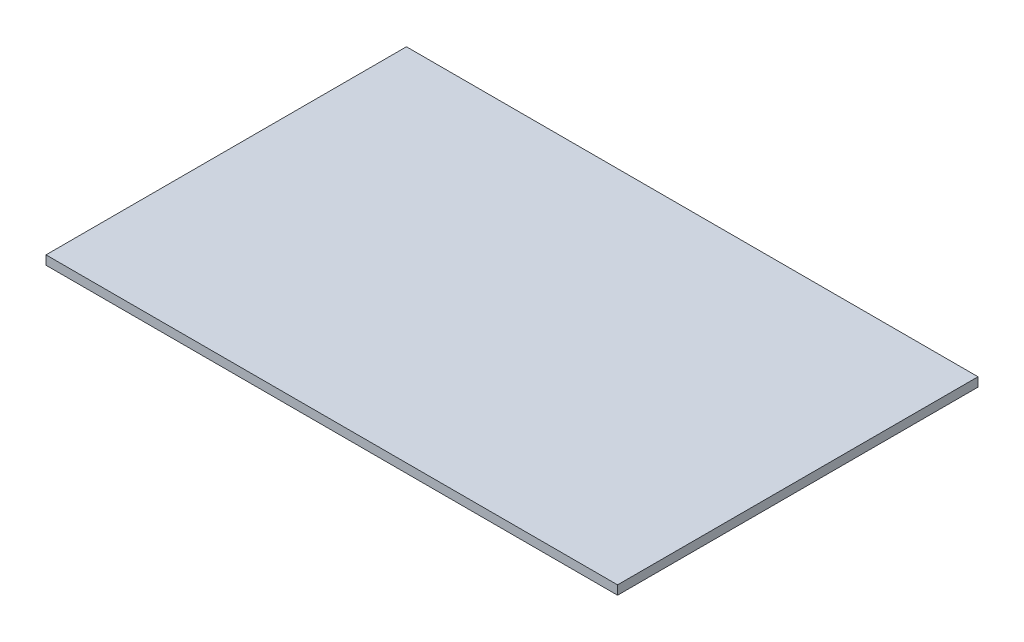
ISO-10303-21;
HEADER;
FILE_DESCRIPTION(('STEP AP214'),'2;1');
FILE_NAME('part.step','',(''),(''),'','','');
FILE_SCHEMA(('AUTOMOTIVE_DESIGN { 1 0 10303 214 1 1 1 1 }'));
ENDSEC;
DATA;
#1=APPLICATION_CONTEXT('core data for automotive mechanical design processes');
#2=APPLICATION_PROTOCOL_DEFINITION('international standard','automotive_design',2000,#1);
#3=PRODUCT_CONTEXT('',#1,'mechanical');
#4=PRODUCT('Part','Part','',(#3));
#5=PRODUCT_RELATED_PRODUCT_CATEGORY('part','',(#4));
#6=PRODUCT_DEFINITION_FORMATION('','',#4);
#7=PRODUCT_DEFINITION_CONTEXT('part definition',#1,'design');
#8=PRODUCT_DEFINITION('design','',#6,#7);
#9=PRODUCT_DEFINITION_SHAPE('','',#8);
#10=(LENGTH_UNIT() NAMED_UNIT(*) SI_UNIT(.MILLI.,.METRE.));
#11=(NAMED_UNIT(*) PLANE_ANGLE_UNIT() SI_UNIT($,.RADIAN.));
#12=(NAMED_UNIT(*) SI_UNIT($,.STERADIAN.) SOLID_ANGLE_UNIT());
#13=UNCERTAINTY_MEASURE_WITH_UNIT(LENGTH_MEASURE(1.E-05),#10,'distance_accuracy_value','');
#14=(GEOMETRIC_REPRESENTATION_CONTEXT(3) GLOBAL_UNCERTAINTY_ASSIGNED_CONTEXT((#13)) GLOBAL_UNIT_ASSIGNED_CONTEXT((#10,
#11,#12)) REPRESENTATION_CONTEXT('',''));
#15=CARTESIAN_POINT('',(0.,0.,0.));
#16=DIRECTION('',(0.,0.,1.));
#17=DIRECTION('',(1.,0.,0.));
#18=AXIS2_PLACEMENT_3D('',#15,#16,#17);
#19=CARTESIAN_POINT('',(-42.8,1.35,26.99));
#20=DIRECTION('',(1.,0.,0.));
#21=DIRECTION('',(0.,0.,-1.));
#22=AXIS2_PLACEMENT_3D('',#19,#20,#21);
#23=PLANE('',#22);
#24=DIRECTION('',(0.,0.,1.));
#25=VECTOR('',#24,1.);
#26=CARTESIAN_POINT('',(-42.8,0.,26.99));
#27=LINE('',#26,#25);
#28=CARTESIAN_POINT('',(-42.8,0.,-26.99));
#29=VERTEX_POINT('',#28);
#30=CARTESIAN_POINT('',(-42.8,0.,26.99));
#31=VERTEX_POINT('',#30);
#32=EDGE_CURVE('E99',#29,#31,#27,.T.);
#33=ORIENTED_EDGE('',*,*,#32,.T.);
#34=DIRECTION('',(0.,-1.,0.));
#35=VECTOR('',#34,1.);
#36=CARTESIAN_POINT('',(-42.8,1.35,26.99));
#37=LINE('',#36,#35);
#38=CARTESIAN_POINT('',(-42.8,1.35,26.99));
#39=VERTEX_POINT('',#38);
#40=EDGE_CURVE('E11',#39,#31,#37,.T.);
#41=ORIENTED_EDGE('',*,*,#40,.F.);
#42=DIRECTION('',(0.,0.,1.));
#43=VECTOR('',#42,1.);
#44=CARTESIAN_POINT('',(-42.8,1.35,26.99));
#45=LINE('',#44,#43);
#46=CARTESIAN_POINT('',(-42.8,1.35,-26.99));
#47=VERTEX_POINT('',#46);
#48=EDGE_CURVE('E87',#47,#39,#45,.T.);
#49=ORIENTED_EDGE('',*,*,#48,.F.);
#50=DIRECTION('',(0.,-1.,0.));
#51=VECTOR('',#50,1.);
#52=CARTESIAN_POINT('',(-42.8,1.35,-26.99));
#53=LINE('',#52,#51);
#54=EDGE_CURVE('E95',#47,#29,#53,.T.);
#55=ORIENTED_EDGE('',*,*,#54,.T.);
#56=EDGE_LOOP('',(#33,#41,#49,#55));
#57=FACE_BOUND('',#56,.T.);
#58=ADVANCED_FACE('F36',(#57),#23,.F.);
#59=CARTESIAN_POINT('',(42.8,1.35,26.99));
#60=DIRECTION('',(0.,0.,-1.));
#61=DIRECTION('',(-1.,0.,0.));
#62=AXIS2_PLACEMENT_3D('',#59,#60,#61);
#63=PLANE('',#62);
#64=DIRECTION('',(1.,0.,0.));
#65=VECTOR('',#64,1.);
#66=CARTESIAN_POINT('',(42.8,0.,26.99));
#67=LINE('',#66,#65);
#68=CARTESIAN_POINT('',(42.8,0.,26.99));
#69=VERTEX_POINT('',#68);
#70=EDGE_CURVE('E91',#31,#69,#67,.T.);
#71=ORIENTED_EDGE('',*,*,#70,.T.);
#72=DIRECTION('',(0.,-1.,0.));
#73=VECTOR('',#72,1.);
#74=CARTESIAN_POINT('',(42.8,1.35,26.99));
#75=LINE('',#74,#73);
#76=CARTESIAN_POINT('',(42.8,1.35,26.99));
#77=VERTEX_POINT('',#76);
#78=EDGE_CURVE('E44',#77,#69,#75,.T.);
#79=ORIENTED_EDGE('',*,*,#78,.F.);
#80=DIRECTION('',(1.,0.,0.));
#81=VECTOR('',#80,1.);
#82=CARTESIAN_POINT('',(42.8,1.35,26.99));
#83=LINE('',#82,#81);
#84=EDGE_CURVE('E82',#39,#77,#83,.T.);
#85=ORIENTED_EDGE('',*,*,#84,.F.);
#86=ORIENTED_EDGE('',*,*,#40,.T.);
#87=EDGE_LOOP('',(#71,#79,#85,#86));
#88=FACE_BOUND('',#87,.T.);
#89=ADVANCED_FACE('F90',(#88),#63,.F.);
#90=CARTESIAN_POINT('',(42.8,1.35,26.99));
#91=DIRECTION('',(-1.,0.,0.));
#92=DIRECTION('',(0.,0.,1.));
#93=AXIS2_PLACEMENT_3D('',#90,#91,#92);
#94=PLANE('',#93);
#95=DIRECTION('',(0.,0.,-1.));
#96=VECTOR('',#95,1.);
#97=CARTESIAN_POINT('',(42.8,0.,26.99));
#98=LINE('',#97,#96);
#99=CARTESIAN_POINT('',(42.8,0.,-26.99));
#100=VERTEX_POINT('',#99);
#101=EDGE_CURVE('E69',#69,#100,#98,.T.);
#102=ORIENTED_EDGE('',*,*,#101,.T.);
#103=DIRECTION('',(0.,-1.,0.));
#104=VECTOR('',#103,1.);
#105=CARTESIAN_POINT('',(42.8,1.35,-26.99));
#106=LINE('',#105,#104);
#107=CARTESIAN_POINT('',(42.8,1.35,-26.99));
#108=VERTEX_POINT('',#107);
#109=EDGE_CURVE('E92',#108,#100,#106,.T.);
#110=ORIENTED_EDGE('',*,*,#109,.F.);
#111=DIRECTION('',(0.,0.,-1.));
#112=VECTOR('',#111,1.);
#113=CARTESIAN_POINT('',(42.8,1.35,26.99));
#114=LINE('',#113,#112);
#115=EDGE_CURVE('E85',#77,#108,#114,.T.);
#116=ORIENTED_EDGE('',*,*,#115,.F.);
#117=ORIENTED_EDGE('',*,*,#78,.T.);
#118=EDGE_LOOP('',(#102,#110,#116,#117));
#119=FACE_BOUND('',#118,.T.);
#120=ADVANCED_FACE('F93',(#119),#94,.F.);
#121=CARTESIAN_POINT('',(42.8,1.35,-26.99));
#122=DIRECTION('',(0.,0.,1.));
#123=DIRECTION('',(1.,0.,0.));
#124=AXIS2_PLACEMENT_3D('',#121,#122,#123);
#125=PLANE('',#124);
#126=DIRECTION('',(-1.,0.,0.));
#127=VECTOR('',#126,1.);
#128=CARTESIAN_POINT('',(42.8,0.,-26.99));
#129=LINE('',#128,#127);
#130=EDGE_CURVE('E75',#100,#29,#129,.T.);
#131=ORIENTED_EDGE('',*,*,#130,.T.);
#132=ORIENTED_EDGE('',*,*,#54,.F.);
#133=DIRECTION('',(-1.,0.,0.));
#134=VECTOR('',#133,1.);
#135=CARTESIAN_POINT('',(42.8,1.35,-26.99));
#136=LINE('',#135,#134);
#137=EDGE_CURVE('E52',#108,#47,#136,.T.);
#138=ORIENTED_EDGE('',*,*,#137,.F.);
#139=ORIENTED_EDGE('',*,*,#109,.T.);
#140=EDGE_LOOP('',(#131,#132,#138,#139));
#141=FACE_BOUND('',#140,.T.);
#142=ADVANCED_FACE('F106',(#141),#125,.F.);
#143=CARTESIAN_POINT('',(-42.8,1.35,-26.99));
#144=DIRECTION('',(0.,1.,0.));
#145=DIRECTION('',(0.,0.,1.));
#146=AXIS2_PLACEMENT_3D('',#143,#144,#145);
#147=PLANE('',#146);
#148=ORIENTED_EDGE('',*,*,#48,.T.);
#149=ORIENTED_EDGE('',*,*,#84,.T.);
#150=ORIENTED_EDGE('',*,*,#115,.T.);
#151=ORIENTED_EDGE('',*,*,#137,.T.);
#152=EDGE_LOOP('',(#148,#149,#150,#151));
#153=FACE_BOUND('',#152,.T.);
#154=ADVANCED_FACE('F83',(#153),#147,.T.);
#155=CARTESIAN_POINT('',(-42.8,0.,-26.99));
#156=DIRECTION('',(0.,1.,0.));
#157=DIRECTION('',(0.,0.,1.));
#158=AXIS2_PLACEMENT_3D('',#155,#156,#157);
#159=PLANE('',#158);
#160=ORIENTED_EDGE('',*,*,#32,.F.);
#161=ORIENTED_EDGE('',*,*,#130,.F.);
#162=ORIENTED_EDGE('',*,*,#101,.F.);
#163=ORIENTED_EDGE('',*,*,#70,.F.);
#164=EDGE_LOOP('',(#160,#161,#162,#163));
#165=FACE_BOUND('',#164,.T.);
#166=ADVANCED_FACE('F109',(#165),#159,.F.);
#167=CLOSED_SHELL('',(#58,#89,#120,#142,#154,#166));
#168=MANIFOLD_SOLID_BREP('B2',#167);
#169=ADVANCED_BREP_SHAPE_REPRESENTATION('',(#18,#168),#14);
#170=SHAPE_DEFINITION_REPRESENTATION(#9,#169);
ENDSEC;
END-ISO-10303-21;
